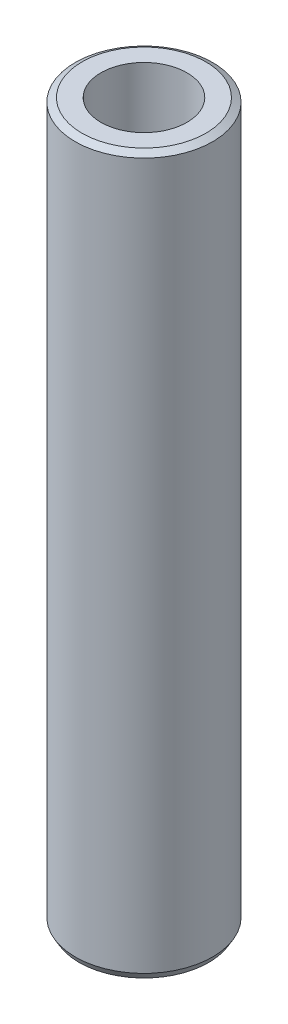
ISO-10303-21;
HEADER;
FILE_DESCRIPTION(('STEP AP214'),'2;1');
FILE_NAME('part.step','',(''),(''),'','','');
FILE_SCHEMA(('AUTOMOTIVE_DESIGN { 1 0 10303 214 1 1 1 1 }'));
ENDSEC;
DATA;
#1=APPLICATION_CONTEXT('core data for automotive mechanical design processes');
#2=APPLICATION_PROTOCOL_DEFINITION('international standard','automotive_design',2000,#1);
#3=PRODUCT_CONTEXT('',#1,'mechanical');
#4=PRODUCT('Part','Part','',(#3));
#5=PRODUCT_RELATED_PRODUCT_CATEGORY('part','',(#4));
#6=PRODUCT_DEFINITION_FORMATION('','',#4);
#7=PRODUCT_DEFINITION_CONTEXT('part definition',#1,'design');
#8=PRODUCT_DEFINITION('design','',#6,#7);
#9=PRODUCT_DEFINITION_SHAPE('','',#8);
#10=(LENGTH_UNIT() NAMED_UNIT(*) SI_UNIT(.MILLI.,.METRE.));
#11=(NAMED_UNIT(*) PLANE_ANGLE_UNIT() SI_UNIT($,.RADIAN.));
#12=(NAMED_UNIT(*) SI_UNIT($,.STERADIAN.) SOLID_ANGLE_UNIT());
#13=UNCERTAINTY_MEASURE_WITH_UNIT(LENGTH_MEASURE(1.E-05),#10,'distance_accuracy_value','');
#14=(GEOMETRIC_REPRESENTATION_CONTEXT(3) GLOBAL_UNCERTAINTY_ASSIGNED_CONTEXT((#13)) GLOBAL_UNIT_ASSIGNED_CONTEXT((#10,
#11,#12)) REPRESENTATION_CONTEXT('',''));
#15=CARTESIAN_POINT('',(0.,0.,0.));
#16=DIRECTION('',(0.,0.,1.));
#17=DIRECTION('',(1.,0.,0.));
#18=AXIS2_PLACEMENT_3D('',#15,#16,#17);
#19=CARTESIAN_POINT('',(0.,600.,0.));
#20=DIRECTION('',(0.,-1.,0.));
#21=DIRECTION('',(0.,0.,-1.));
#22=AXIS2_PLACEMENT_3D('',#19,#20,#21);
#23=CYLINDRICAL_SURFACE('',#22,57.5);
#24=CARTESIAN_POINT('',(0.,596.720652799355,0.));
#25=DIRECTION('',(0.,1.,0.));
#26=DIRECTION('',(0.,0.,1.));
#27=AXIS2_PLACEMENT_3D('',#24,#25,#26);
#28=CIRCLE('',#27,57.5);
#29=CARTESIAN_POINT('',(0.,596.720652799355,57.5));
#30=VERTEX_POINT('',#29);
#31=EDGE_CURVE('E50',#30,#30,#28,.F.);
#32=ORIENTED_EDGE('',*,*,#31,.T.);
#33=EDGE_LOOP('',(#32));
#34=FACE_BOUND('',#33,.T.);
#35=CARTESIAN_POINT('',(0.,5.6799959671765,0.));
#36=DIRECTION('',(0.,1.,0.));
#37=DIRECTION('',(0.,0.,1.));
#38=AXIS2_PLACEMENT_3D('',#35,#36,#37);
#39=CIRCLE('',#38,57.5);
#40=CARTESIAN_POINT('',(0.,5.6799959671765,57.5));
#41=VERTEX_POINT('',#40);
#42=EDGE_CURVE('E51',#41,#41,#39,.T.);
#43=ORIENTED_EDGE('',*,*,#42,.T.);
#44=EDGE_LOOP('',(#43));
#45=FACE_BOUND('',#44,.T.);
#46=ADVANCED_FACE('F39',(#34,#45),#23,.T.);
#47=CARTESIAN_POINT('',(0.,600.,0.));
#48=DIRECTION('',(0.,1.,0.));
#49=DIRECTION('',(0.,0.,1.));
#50=AXIS2_PLACEMENT_3D('',#47,#48,#49);
#51=PLANE('',#50);
#52=CARTESIAN_POINT('',(0.,600.,0.));
#53=DIRECTION('',(0.,1.,0.));
#54=DIRECTION('',(0.,0.,1.));
#55=AXIS2_PLACEMENT_3D('',#52,#53,#54);
#56=CIRCLE('',#55,51.8200040328235);
#57=CARTESIAN_POINT('',(0.,600.,51.8200040328235));
#58=VERTEX_POINT('',#57);
#59=EDGE_CURVE('E54',#58,#58,#56,.T.);
#60=ORIENTED_EDGE('',*,*,#59,.T.);
#61=EDGE_LOOP('',(#60));
#62=FACE_BOUND('',#61,.T.);
#63=CARTESIAN_POINT('',(0.,600.,0.));
#64=DIRECTION('',(0.,1.,0.));
#65=DIRECTION('',(0.,0.,1.));
#66=AXIS2_PLACEMENT_3D('',#63,#64,#65);
#67=CIRCLE('',#66,36.0158009915678);
#68=CARTESIAN_POINT('',(0.,600.,36.0158009915678));
#69=VERTEX_POINT('',#68);
#70=EDGE_CURVE('E58',#69,#69,#67,.T.);
#71=ORIENTED_EDGE('',*,*,#70,.F.);
#72=EDGE_LOOP('',(#71));
#73=FACE_BOUND('',#72,.T.);
#74=ADVANCED_FACE('F69',(#62,#73),#51,.T.);
#75=CARTESIAN_POINT('',(0.,0.,0.));
#76=DIRECTION('',(0.,1.,0.));
#77=DIRECTION('',(0.,0.,1.));
#78=AXIS2_PLACEMENT_3D('',#75,#76,#77);
#79=PLANE('',#78);
#80=CARTESIAN_POINT('',(0.,0.,0.));
#81=DIRECTION('',(0.,1.,0.));
#82=DIRECTION('',(0.,0.,1.));
#83=AXIS2_PLACEMENT_3D('',#80,#81,#82);
#84=CIRCLE('',#83,54.2206527993546);
#85=CARTESIAN_POINT('',(0.,0.,54.2206527993546));
#86=VERTEX_POINT('',#85);
#87=EDGE_CURVE('E10',#86,#86,#84,.F.);
#88=ORIENTED_EDGE('',*,*,#87,.T.);
#89=EDGE_LOOP('',(#88));
#90=FACE_BOUND('',#89,.T.);
#91=CARTESIAN_POINT('',(0.,0.,0.));
#92=DIRECTION('',(0.,1.,0.));
#93=DIRECTION('',(0.,0.,1.));
#94=AXIS2_PLACEMENT_3D('',#91,#92,#93);
#95=CIRCLE('',#94,36.0158009915678);
#96=CARTESIAN_POINT('',(0.,0.,36.0158009915678));
#97=VERTEX_POINT('',#96);
#98=EDGE_CURVE('E63',#97,#97,#95,.T.);
#99=ORIENTED_EDGE('',*,*,#98,.T.);
#100=EDGE_LOOP('',(#99));
#101=FACE_BOUND('',#100,.T.);
#102=ADVANCED_FACE('F75',(#90,#101),#79,.F.);
#103=CARTESIAN_POINT('',(0.,600.,0.));
#104=DIRECTION('',(0.,-1.,0.));
#105=DIRECTION('',(0.,0.,-1.));
#106=AXIS2_PLACEMENT_3D('',#103,#104,#105);
#107=CYLINDRICAL_SURFACE('',#106,36.0158009915678);
#108=ORIENTED_EDGE('',*,*,#70,.T.);
#109=EDGE_LOOP('',(#108));
#110=FACE_BOUND('',#109,.T.);
#111=ORIENTED_EDGE('',*,*,#98,.F.);
#112=EDGE_LOOP('',(#111));
#113=FACE_BOUND('',#112,.T.);
#114=ADVANCED_FACE('F70',(#110,#113),#107,.F.);
#115=CARTESIAN_POINT('',(0.,600.,0.));
#116=DIRECTION('',(0.,-1.,0.));
#117=DIRECTION('',(0.,0.,-1.));
#118=AXIS2_PLACEMENT_3D('',#115,#116,#117);
#119=CONICAL_SURFACE('',#118,51.8200040328235,1.04719755119659);
#120=ORIENTED_EDGE('',*,*,#31,.F.);
#121=EDGE_LOOP('',(#120));
#122=FACE_BOUND('',#121,.T.);
#123=ORIENTED_EDGE('',*,*,#59,.F.);
#124=EDGE_LOOP('',(#123));
#125=FACE_BOUND('',#124,.T.);
#126=ADVANCED_FACE('F81',(#122,#125),#119,.T.);
#127=CARTESIAN_POINT('',(0.,5.6799959671765,0.));
#128=DIRECTION('',(0.,1.,0.));
#129=DIRECTION('',(0.,0.,1.));
#130=AXIS2_PLACEMENT_3D('',#127,#128,#129);
#131=CONICAL_SURFACE('',#130,57.5,0.523598775598305);
#132=ORIENTED_EDGE('',*,*,#87,.F.);
#133=EDGE_LOOP('',(#132));
#134=FACE_BOUND('',#133,.T.);
#135=ORIENTED_EDGE('',*,*,#42,.F.);
#136=EDGE_LOOP('',(#135));
#137=FACE_BOUND('',#136,.T.);
#138=ADVANCED_FACE('F45',(#134,#137),#131,.T.);
#139=CLOSED_SHELL('',(#46,#74,#102,#114,#126,#138));
#140=MANIFOLD_SOLID_BREP('B2',#139);
#141=ADVANCED_BREP_SHAPE_REPRESENTATION('',(#18,#140),#14);
#142=SHAPE_DEFINITION_REPRESENTATION(#9,#141);
ENDSEC;
END-ISO-10303-21;
